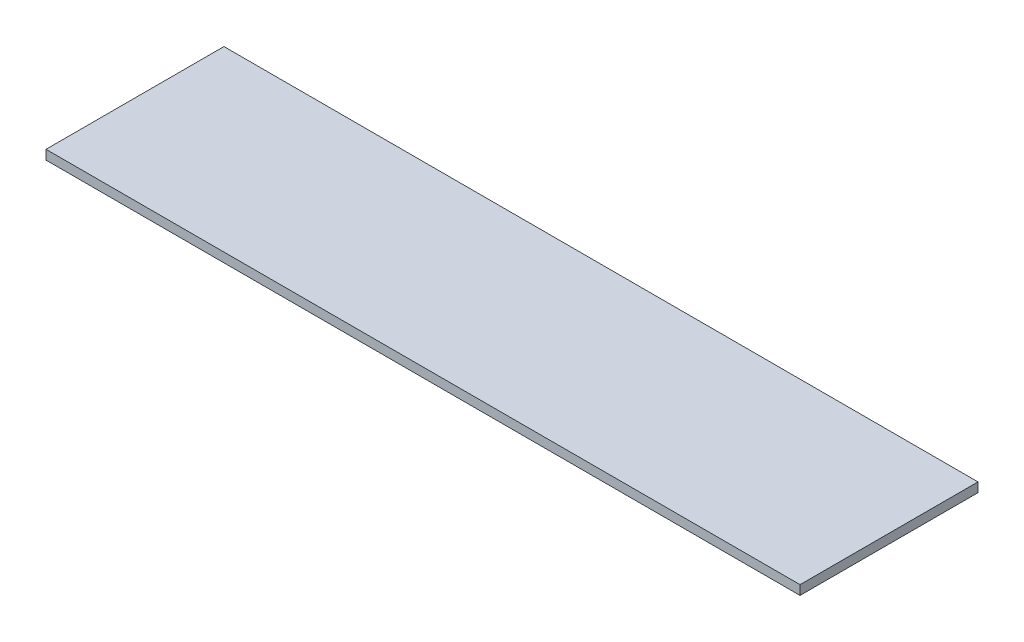
ISO-10303-21;
HEADER;
FILE_DESCRIPTION(('STEP AP214'),'2;1');
FILE_NAME('part.step','',(''),(''),'','','');
FILE_SCHEMA(('AUTOMOTIVE_DESIGN { 1 0 10303 214 1 1 1 1 }'));
ENDSEC;
DATA;
#1=APPLICATION_CONTEXT('core data for automotive mechanical design processes');
#2=APPLICATION_PROTOCOL_DEFINITION('international standard','automotive_design',2000,#1);
#3=PRODUCT_CONTEXT('',#1,'mechanical');
#4=PRODUCT('Part','Part','',(#3));
#5=PRODUCT_RELATED_PRODUCT_CATEGORY('part','',(#4));
#6=PRODUCT_DEFINITION_FORMATION('','',#4);
#7=PRODUCT_DEFINITION_CONTEXT('part definition',#1,'design');
#8=PRODUCT_DEFINITION('design','',#6,#7);
#9=PRODUCT_DEFINITION_SHAPE('','',#8);
#10=(LENGTH_UNIT() NAMED_UNIT(*) SI_UNIT(.MILLI.,.METRE.));
#11=(NAMED_UNIT(*) PLANE_ANGLE_UNIT() SI_UNIT($,.RADIAN.));
#12=(NAMED_UNIT(*) SI_UNIT($,.STERADIAN.) SOLID_ANGLE_UNIT());
#13=UNCERTAINTY_MEASURE_WITH_UNIT(LENGTH_MEASURE(1.E-05),#10,'distance_accuracy_value','');
#14=(GEOMETRIC_REPRESENTATION_CONTEXT(3) GLOBAL_UNCERTAINTY_ASSIGNED_CONTEXT((#13)) GLOBAL_UNIT_ASSIGNED_CONTEXT((#10,
#11,#12)) REPRESENTATION_CONTEXT('',''));
#15=CARTESIAN_POINT('',(0.,0.,0.));
#16=DIRECTION('',(0.,0.,1.));
#17=DIRECTION('',(1.,0.,0.));
#18=AXIS2_PLACEMENT_3D('',#15,#16,#17);
#19=CARTESIAN_POINT('',(0.,6.35,0.));
#20=DIRECTION('',(1.,0.,0.));
#21=DIRECTION('',(0.,0.,-1.));
#22=AXIS2_PLACEMENT_3D('',#19,#20,#21);
#23=PLANE('',#22);
#24=DIRECTION('',(0.,0.,1.));
#25=VECTOR('',#24,1.);
#26=CARTESIAN_POINT('',(0.,0.,0.));
#27=LINE('',#26,#25);
#28=CARTESIAN_POINT('',(0.,0.,-120.65));
#29=VERTEX_POINT('',#28);
#30=CARTESIAN_POINT('',(0.,0.,0.));
#31=VERTEX_POINT('',#30);
#32=EDGE_CURVE('E98',#29,#31,#27,.T.);
#33=ORIENTED_EDGE('',*,*,#32,.T.);
#34=DIRECTION('',(0.,-1.,0.));
#35=VECTOR('',#34,1.);
#36=CARTESIAN_POINT('',(0.,6.35,0.));
#37=LINE('',#36,#35);
#38=CARTESIAN_POINT('',(0.,6.35,0.));
#39=VERTEX_POINT('',#38);
#40=EDGE_CURVE('E11',#39,#31,#37,.T.);
#41=ORIENTED_EDGE('',*,*,#40,.F.);
#42=DIRECTION('',(0.,0.,1.));
#43=VECTOR('',#42,1.);
#44=CARTESIAN_POINT('',(0.,6.35,0.));
#45=LINE('',#44,#43);
#46=CARTESIAN_POINT('',(0.,6.35,-120.65));
#47=VERTEX_POINT('',#46);
#48=EDGE_CURVE('E86',#47,#39,#45,.T.);
#49=ORIENTED_EDGE('',*,*,#48,.F.);
#50=DIRECTION('',(0.,-1.,0.));
#51=VECTOR('',#50,1.);
#52=CARTESIAN_POINT('',(0.,6.35,-120.65));
#53=LINE('',#52,#51);
#54=EDGE_CURVE('E94',#47,#29,#53,.T.);
#55=ORIENTED_EDGE('',*,*,#54,.T.);
#56=EDGE_LOOP('',(#33,#41,#49,#55));
#57=FACE_BOUND('',#56,.T.);
#58=ADVANCED_FACE('F35',(#57),#23,.F.);
#59=CARTESIAN_POINT('',(0.,6.35,0.));
#60=DIRECTION('',(0.,0.,-1.));
#61=DIRECTION('',(-1.,0.,0.));
#62=AXIS2_PLACEMENT_3D('',#59,#60,#61);
#63=PLANE('',#62);
#64=DIRECTION('',(1.,0.,0.));
#65=VECTOR('',#64,1.);
#66=CARTESIAN_POINT('',(0.,0.,0.));
#67=LINE('',#66,#65);
#68=CARTESIAN_POINT('',(511.175,0.,0.));
#69=VERTEX_POINT('',#68);
#70=EDGE_CURVE('E90',#31,#69,#67,.T.);
#71=ORIENTED_EDGE('',*,*,#70,.T.);
#72=DIRECTION('',(0.,-1.,0.));
#73=VECTOR('',#72,1.);
#74=CARTESIAN_POINT('',(511.175,6.35,0.));
#75=LINE('',#74,#73);
#76=CARTESIAN_POINT('',(511.175,6.35,0.));
#77=VERTEX_POINT('',#76);
#78=EDGE_CURVE('E43',#77,#69,#75,.T.);
#79=ORIENTED_EDGE('',*,*,#78,.F.);
#80=DIRECTION('',(1.,0.,0.));
#81=VECTOR('',#80,1.);
#82=CARTESIAN_POINT('',(0.,6.35,0.));
#83=LINE('',#82,#81);
#84=EDGE_CURVE('E81',#39,#77,#83,.T.);
#85=ORIENTED_EDGE('',*,*,#84,.F.);
#86=ORIENTED_EDGE('',*,*,#40,.T.);
#87=EDGE_LOOP('',(#71,#79,#85,#86));
#88=FACE_BOUND('',#87,.T.);
#89=ADVANCED_FACE('F89',(#88),#63,.F.);
#90=CARTESIAN_POINT('',(511.175,6.35,0.));
#91=DIRECTION('',(-1.,0.,0.));
#92=DIRECTION('',(0.,0.,1.));
#93=AXIS2_PLACEMENT_3D('',#90,#91,#92);
#94=PLANE('',#93);
#95=DIRECTION('',(0.,0.,-1.));
#96=VECTOR('',#95,1.);
#97=CARTESIAN_POINT('',(511.175,0.,0.));
#98=LINE('',#97,#96);
#99=CARTESIAN_POINT('',(511.175,0.,-120.65));
#100=VERTEX_POINT('',#99);
#101=EDGE_CURVE('E68',#69,#100,#98,.T.);
#102=ORIENTED_EDGE('',*,*,#101,.T.);
#103=DIRECTION('',(0.,-1.,0.));
#104=VECTOR('',#103,1.);
#105=CARTESIAN_POINT('',(511.175,6.35,-120.65));
#106=LINE('',#105,#104);
#107=CARTESIAN_POINT('',(511.175,6.35,-120.65));
#108=VERTEX_POINT('',#107);
#109=EDGE_CURVE('E91',#108,#100,#106,.T.);
#110=ORIENTED_EDGE('',*,*,#109,.F.);
#111=DIRECTION('',(0.,0.,-1.));
#112=VECTOR('',#111,1.);
#113=CARTESIAN_POINT('',(511.175,6.35,0.));
#114=LINE('',#113,#112);
#115=EDGE_CURVE('E84',#77,#108,#114,.T.);
#116=ORIENTED_EDGE('',*,*,#115,.F.);
#117=ORIENTED_EDGE('',*,*,#78,.T.);
#118=EDGE_LOOP('',(#102,#110,#116,#117));
#119=FACE_BOUND('',#118,.T.);
#120=ADVANCED_FACE('F92',(#119),#94,.F.);
#121=CARTESIAN_POINT('',(0.,6.35,-120.65));
#122=DIRECTION('',(0.,0.,1.));
#123=DIRECTION('',(1.,0.,0.));
#124=AXIS2_PLACEMENT_3D('',#121,#122,#123);
#125=PLANE('',#124);
#126=DIRECTION('',(-1.,0.,0.));
#127=VECTOR('',#126,1.);
#128=CARTESIAN_POINT('',(0.,0.,-120.65));
#129=LINE('',#128,#127);
#130=EDGE_CURVE('E74',#100,#29,#129,.T.);
#131=ORIENTED_EDGE('',*,*,#130,.T.);
#132=ORIENTED_EDGE('',*,*,#54,.F.);
#133=DIRECTION('',(-1.,0.,0.));
#134=VECTOR('',#133,1.);
#135=CARTESIAN_POINT('',(0.,6.35,-120.65));
#136=LINE('',#135,#134);
#137=EDGE_CURVE('E51',#108,#47,#136,.T.);
#138=ORIENTED_EDGE('',*,*,#137,.F.);
#139=ORIENTED_EDGE('',*,*,#109,.T.);
#140=EDGE_LOOP('',(#131,#132,#138,#139));
#141=FACE_BOUND('',#140,.T.);
#142=ADVANCED_FACE('F105',(#141),#125,.F.);
#143=CARTESIAN_POINT('',(0.,6.35,0.));
#144=DIRECTION('',(0.,-1.,0.));
#145=DIRECTION('',(0.,0.,-1.));
#146=AXIS2_PLACEMENT_3D('',#143,#144,#145);
#147=PLANE('',#146);
#148=ORIENTED_EDGE('',*,*,#48,.T.);
#149=ORIENTED_EDGE('',*,*,#84,.T.);
#150=ORIENTED_EDGE('',*,*,#115,.T.);
#151=ORIENTED_EDGE('',*,*,#137,.T.);
#152=EDGE_LOOP('',(#148,#149,#150,#151));
#153=FACE_BOUND('',#152,.T.);
#154=ADVANCED_FACE('F82',(#153),#147,.F.);
#155=CARTESIAN_POINT('',(0.,0.,0.));
#156=DIRECTION('',(0.,-1.,0.));
#157=DIRECTION('',(0.,0.,-1.));
#158=AXIS2_PLACEMENT_3D('',#155,#156,#157);
#159=PLANE('',#158);
#160=ORIENTED_EDGE('',*,*,#32,.F.);
#161=ORIENTED_EDGE('',*,*,#130,.F.);
#162=ORIENTED_EDGE('',*,*,#101,.F.);
#163=ORIENTED_EDGE('',*,*,#70,.F.);
#164=EDGE_LOOP('',(#160,#161,#162,#163));
#165=FACE_BOUND('',#164,.T.);
#166=ADVANCED_FACE('F108',(#165),#159,.T.);
#167=CLOSED_SHELL('',(#58,#89,#120,#142,#154,#166));
#168=MANIFOLD_SOLID_BREP('B2',#167);
#169=ADVANCED_BREP_SHAPE_REPRESENTATION('',(#18,#168),#14);
#170=SHAPE_DEFINITION_REPRESENTATION(#9,#169);
ENDSEC;
END-ISO-10303-21;
